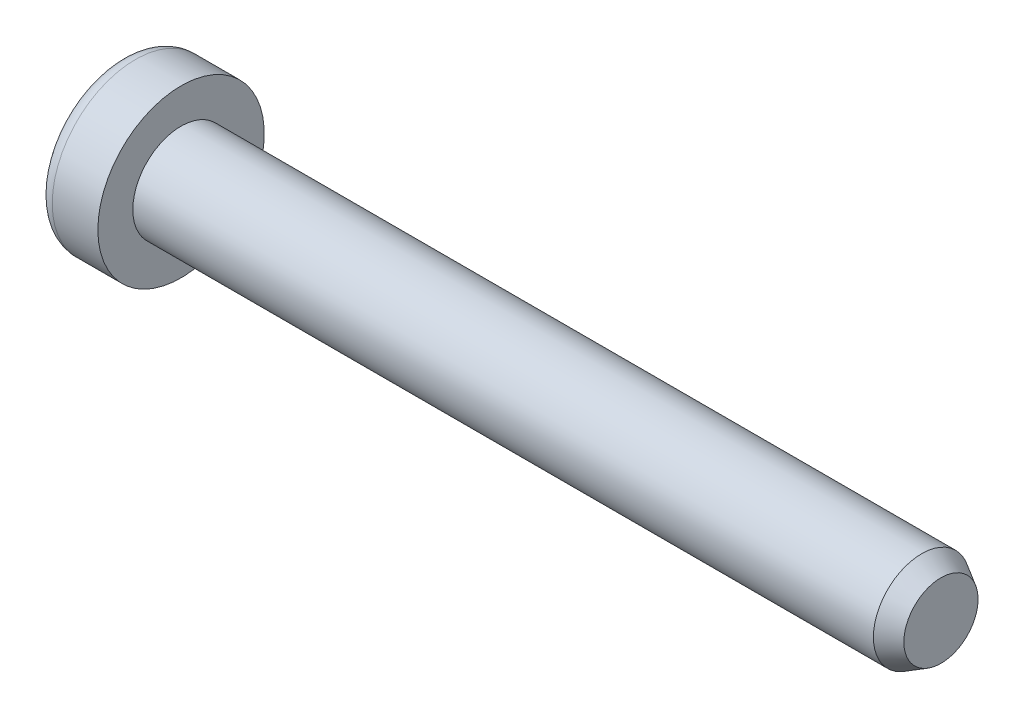
ISO-10303-21;
HEADER;
FILE_DESCRIPTION(('STEP AP214'),'2;1');
FILE_NAME('part.step','',(''),(''),'','','');
FILE_SCHEMA(('AUTOMOTIVE_DESIGN { 1 0 10303 214 1 1 1 1 }'));
ENDSEC;
DATA;
#1=APPLICATION_CONTEXT('core data for automotive mechanical design processes');
#2=APPLICATION_PROTOCOL_DEFINITION('international standard','automotive_design',2000,#1);
#3=PRODUCT_CONTEXT('',#1,'mechanical');
#4=PRODUCT('Part','Part','',(#3));
#5=PRODUCT_RELATED_PRODUCT_CATEGORY('part','',(#4));
#6=PRODUCT_DEFINITION_FORMATION('','',#4);
#7=PRODUCT_DEFINITION_CONTEXT('part definition',#1,'design');
#8=PRODUCT_DEFINITION('design','',#6,#7);
#9=PRODUCT_DEFINITION_SHAPE('','',#8);
#10=(LENGTH_UNIT() NAMED_UNIT(*) SI_UNIT(.MILLI.,.METRE.));
#11=(NAMED_UNIT(*) PLANE_ANGLE_UNIT() SI_UNIT($,.RADIAN.));
#12=(NAMED_UNIT(*) SI_UNIT($,.STERADIAN.) SOLID_ANGLE_UNIT());
#13=UNCERTAINTY_MEASURE_WITH_UNIT(LENGTH_MEASURE(1.E-05),#10,'distance_accuracy_value','');
#14=(GEOMETRIC_REPRESENTATION_CONTEXT(3) GLOBAL_UNCERTAINTY_ASSIGNED_CONTEXT((#13)) GLOBAL_UNIT_ASSIGNED_CONTEXT((#10,
#11,#12)) REPRESENTATION_CONTEXT('',''));
#15=CARTESIAN_POINT('',(0.,0.,0.));
#16=DIRECTION('',(0.,0.,1.));
#17=DIRECTION('',(1.,0.,0.));
#18=AXIS2_PLACEMENT_3D('',#15,#16,#17);
#19=CARTESIAN_POINT('',(-0.2794,0.2413,0.2413));
#20=DIRECTION('',(0.,0.,1.));
#21=DIRECTION('',(1.,0.,0.));
#22=AXIS2_PLACEMENT_3D('',#19,#20,#21);
#23=PLANE('',#22);
#24=DIRECTION('',(1.,0.,0.));
#25=VECTOR('',#24,1.);
#26=CARTESIAN_POINT('',(-0.2794,1.4732,0.2413));
#27=LINE('',#26,#25);
#28=CARTESIAN_POINT('',(-2.03199999873,1.4732,0.2413));
#29=VERTEX_POINT('',#28);
#30=CARTESIAN_POINT('',(-0.2794,1.4732,0.2413));
#31=VERTEX_POINT('',#30);
#32=EDGE_CURVE('E123',#29,#31,#27,.T.);
#33=ORIENTED_EDGE('',*,*,#32,.T.);
#34=DIRECTION('',(0.,1.,0.));
#35=VECTOR('',#34,1.);
#36=CARTESIAN_POINT('',(-0.2794,0.2413,0.2413));
#37=LINE('',#36,#35);
#38=CARTESIAN_POINT('',(-0.2794,0.2413,0.2413));
#39=VERTEX_POINT('',#38);
#40=EDGE_CURVE('E113',#39,#31,#37,.T.);
#41=ORIENTED_EDGE('',*,*,#40,.F.);
#42=DIRECTION('',(1.,0.,0.));
#43=VECTOR('',#42,1.);
#44=CARTESIAN_POINT('',(-0.279400000000001,0.2413,0.2413));
#45=LINE('',#44,#43);
#46=CARTESIAN_POINT('',(-2.03199999873,0.2413,0.2413));
#47=VERTEX_POINT('',#46);
#48=EDGE_CURVE('E377',#39,#47,#45,.F.);
#49=ORIENTED_EDGE('',*,*,#48,.T.);
#50=DIRECTION('',(0.,1.,0.));
#51=VECTOR('',#50,1.);
#52=CARTESIAN_POINT('',(-2.03199999873,0.2413,0.2413));
#53=LINE('',#52,#51);
#54=EDGE_CURVE('E108',#29,#47,#53,.F.);
#55=ORIENTED_EDGE('',*,*,#54,.F.);
#56=EDGE_LOOP('',(#33,#41,#49,#55));
#57=FACE_BOUND('',#56,.T.);
#58=ADVANCED_FACE('F17',(#57),#23,.F.);
#59=CARTESIAN_POINT('',(-0.2794,1.4732,0.2413));
#60=DIRECTION('',(0.,1.,0.));
#61=DIRECTION('',(0.,0.,1.));
#62=AXIS2_PLACEMENT_3D('',#59,#60,#61);
#63=PLANE('',#62);
#64=DIRECTION('',(-1.,0.,0.));
#65=VECTOR('',#64,1.);
#66=CARTESIAN_POINT('',(-0.2794,1.4732,-0.2413));
#67=LINE('',#66,#65);
#68=CARTESIAN_POINT('',(-2.03199999873,1.4732,-0.2413));
#69=VERTEX_POINT('',#68);
#70=CARTESIAN_POINT('',(-0.2794,1.4732,-0.2413));
#71=VERTEX_POINT('',#70);
#72=EDGE_CURVE('E128',#69,#71,#67,.F.);
#73=ORIENTED_EDGE('',*,*,#72,.T.);
#74=DIRECTION('',(0.,0.,1.));
#75=VECTOR('',#74,1.);
#76=CARTESIAN_POINT('',(-0.2794,1.4732,0.2413));
#77=LINE('',#76,#75);
#78=EDGE_CURVE('E116',#31,#71,#77,.F.);
#79=ORIENTED_EDGE('',*,*,#78,.F.);
#80=ORIENTED_EDGE('',*,*,#32,.F.);
#81=DIRECTION('',(0.,0.,1.));
#82=VECTOR('',#81,1.);
#83=CARTESIAN_POINT('',(-2.03199999873,1.4732,0.2413));
#84=LINE('',#83,#82);
#85=EDGE_CURVE('E130',#69,#29,#84,.T.);
#86=ORIENTED_EDGE('',*,*,#85,.F.);
#87=EDGE_LOOP('',(#73,#79,#80,#86));
#88=FACE_BOUND('',#87,.T.);
#89=ADVANCED_FACE('F126',(#88),#63,.F.);
#90=CARTESIAN_POINT('',(-0.279400000000001,0.2413,1.4732));
#91=DIRECTION('',(0.,1.,0.));
#92=DIRECTION('',(0.,0.,1.));
#93=AXIS2_PLACEMENT_3D('',#90,#91,#92);
#94=PLANE('',#93);
#95=ORIENTED_EDGE('',*,*,#48,.F.);
#96=DIRECTION('',(0.,0.,1.));
#97=VECTOR('',#96,1.);
#98=CARTESIAN_POINT('',(-0.279400000000001,0.2413,1.4732));
#99=LINE('',#98,#97);
#100=CARTESIAN_POINT('',(-0.279400000000001,0.2413,1.4732));
#101=VERTEX_POINT('',#100);
#102=EDGE_CURVE('E119',#101,#39,#99,.F.);
#103=ORIENTED_EDGE('',*,*,#102,.F.);
#104=DIRECTION('',(1.,0.,0.));
#105=VECTOR('',#104,1.);
#106=CARTESIAN_POINT('',(-0.279400000000001,0.2413,1.4732));
#107=LINE('',#106,#105);
#108=CARTESIAN_POINT('',(-2.03199999873,0.2413,1.4732));
#109=VERTEX_POINT('',#108);
#110=EDGE_CURVE('E392',#101,#109,#107,.F.);
#111=ORIENTED_EDGE('',*,*,#110,.T.);
#112=DIRECTION('',(0.,0.,1.));
#113=VECTOR('',#112,1.);
#114=CARTESIAN_POINT('',(-2.03199999873,0.2413,1.4732));
#115=LINE('',#114,#113);
#116=EDGE_CURVE('E380',#47,#109,#115,.T.);
#117=ORIENTED_EDGE('',*,*,#116,.F.);
#118=EDGE_LOOP('',(#95,#103,#111,#117));
#119=FACE_BOUND('',#118,.T.);
#120=ADVANCED_FACE('F208',(#119),#94,.F.);
#121=CARTESIAN_POINT('',(-0.2794,1.4732,-0.2413));
#122=DIRECTION('',(0.,0.,-1.));
#123=DIRECTION('',(-1.,0.,0.));
#124=AXIS2_PLACEMENT_3D('',#121,#122,#123);
#125=PLANE('',#124);
#126=DIRECTION('',(1.,0.,0.));
#127=VECTOR('',#126,1.);
#128=CARTESIAN_POINT('',(-0.2794,0.2413,-0.2413));
#129=LINE('',#128,#127);
#130=CARTESIAN_POINT('',(-2.03199999873,0.2413,-0.2413));
#131=VERTEX_POINT('',#130);
#132=CARTESIAN_POINT('',(-0.2794,0.2413,-0.2413));
#133=VERTEX_POINT('',#132);
#134=EDGE_CURVE('E396',#131,#133,#129,.T.);
#135=ORIENTED_EDGE('',*,*,#134,.T.);
#136=DIRECTION('',(0.,1.,0.));
#137=VECTOR('',#136,1.);
#138=CARTESIAN_POINT('',(-0.2794,1.4732,-0.2413));
#139=LINE('',#138,#137);
#140=EDGE_CURVE('E385',#71,#133,#139,.F.);
#141=ORIENTED_EDGE('',*,*,#140,.F.);
#142=ORIENTED_EDGE('',*,*,#72,.F.);
#143=DIRECTION('',(0.,1.,0.));
#144=VECTOR('',#143,1.);
#145=CARTESIAN_POINT('',(-2.03199999873,1.4732,-0.2413));
#146=LINE('',#145,#144);
#147=EDGE_CURVE('E387',#131,#69,#146,.T.);
#148=ORIENTED_EDGE('',*,*,#147,.F.);
#149=EDGE_LOOP('',(#135,#141,#142,#148));
#150=FACE_BOUND('',#149,.T.);
#151=ADVANCED_FACE('F204',(#150),#125,.F.);
#152=CARTESIAN_POINT('',(-0.279400000000001,-0.2413,1.4732));
#153=DIRECTION('',(0.,0.,1.));
#154=DIRECTION('',(1.,0.,0.));
#155=AXIS2_PLACEMENT_3D('',#152,#153,#154);
#156=PLANE('',#155);
#157=ORIENTED_EDGE('',*,*,#110,.F.);
#158=DIRECTION('',(0.,1.,0.));
#159=VECTOR('',#158,1.);
#160=CARTESIAN_POINT('',(-0.279400000000001,-0.2413,1.4732));
#161=LINE('',#160,#159);
#162=CARTESIAN_POINT('',(-0.279400000000001,-0.2413,1.4732));
#163=VERTEX_POINT('',#162);
#164=EDGE_CURVE('E390',#163,#101,#161,.T.);
#165=ORIENTED_EDGE('',*,*,#164,.F.);
#166=DIRECTION('',(1.,0.,0.));
#167=VECTOR('',#166,1.);
#168=CARTESIAN_POINT('',(-0.2794,-0.2413,1.4732));
#169=LINE('',#168,#167);
#170=CARTESIAN_POINT('',(-2.03199999873,-0.2413,1.4732));
#171=VERTEX_POINT('',#170);
#172=EDGE_CURVE('E406',#163,#171,#169,.F.);
#173=ORIENTED_EDGE('',*,*,#172,.T.);
#174=DIRECTION('',(0.,1.,0.));
#175=VECTOR('',#174,1.);
#176=CARTESIAN_POINT('',(-2.03199999873,-0.2413,1.4732));
#177=LINE('',#176,#175);
#178=EDGE_CURVE('E394',#109,#171,#177,.F.);
#179=ORIENTED_EDGE('',*,*,#178,.F.);
#180=EDGE_LOOP('',(#157,#165,#173,#179));
#181=FACE_BOUND('',#180,.T.);
#182=ADVANCED_FACE('F200',(#181),#156,.F.);
#183=CARTESIAN_POINT('',(-0.2794,0.2413,-0.2413));
#184=DIRECTION('',(0.,1.,0.));
#185=DIRECTION('',(0.,0.,1.));
#186=AXIS2_PLACEMENT_3D('',#183,#184,#185);
#187=PLANE('',#186);
#188=DIRECTION('',(-1.,0.,0.));
#189=VECTOR('',#188,1.);
#190=CARTESIAN_POINT('',(-0.2794,0.2413,-1.4732));
#191=LINE('',#190,#189);
#192=CARTESIAN_POINT('',(-2.03199999873,0.2413,-1.4732));
#193=VERTEX_POINT('',#192);
#194=CARTESIAN_POINT('',(-0.2794,0.2413,-1.4732));
#195=VERTEX_POINT('',#194);
#196=EDGE_CURVE('E411',#193,#195,#191,.F.);
#197=ORIENTED_EDGE('',*,*,#196,.T.);
#198=DIRECTION('',(0.,0.,1.));
#199=VECTOR('',#198,1.);
#200=CARTESIAN_POINT('',(-0.2794,0.2413,-0.2413));
#201=LINE('',#200,#199);
#202=EDGE_CURVE('E399',#133,#195,#201,.F.);
#203=ORIENTED_EDGE('',*,*,#202,.F.);
#204=ORIENTED_EDGE('',*,*,#134,.F.);
#205=DIRECTION('',(0.,0.,1.));
#206=VECTOR('',#205,1.);
#207=CARTESIAN_POINT('',(-2.03199999873,0.2413,-0.2413));
#208=LINE('',#207,#206);
#209=EDGE_CURVE('E401',#193,#131,#208,.T.);
#210=ORIENTED_EDGE('',*,*,#209,.F.);
#211=EDGE_LOOP('',(#197,#203,#204,#210));
#212=FACE_BOUND('',#211,.T.);
#213=ADVANCED_FACE('F196',(#212),#187,.F.);
#214=CARTESIAN_POINT('',(-0.2794,-0.2413,0.2413));
#215=DIRECTION('',(0.,-1.,0.));
#216=DIRECTION('',(0.,0.,-1.));
#217=AXIS2_PLACEMENT_3D('',#214,#215,#216);
#218=PLANE('',#217);
#219=ORIENTED_EDGE('',*,*,#172,.F.);
#220=DIRECTION('',(0.,0.,-1.));
#221=VECTOR('',#220,1.);
#222=CARTESIAN_POINT('',(-0.2794,-0.2413,0.2413));
#223=LINE('',#222,#221);
#224=CARTESIAN_POINT('',(-0.2794,-0.2413,0.2413));
#225=VERTEX_POINT('',#224);
#226=EDGE_CURVE('E404',#225,#163,#223,.F.);
#227=ORIENTED_EDGE('',*,*,#226,.F.);
#228=DIRECTION('',(1.,0.,0.));
#229=VECTOR('',#228,1.);
#230=CARTESIAN_POINT('',(-0.2794,-0.2413,0.2413));
#231=LINE('',#230,#229);
#232=CARTESIAN_POINT('',(-2.03199999873,-0.2413,0.2413));
#233=VERTEX_POINT('',#232);
#234=EDGE_CURVE('E419',#225,#233,#231,.F.);
#235=ORIENTED_EDGE('',*,*,#234,.T.);
#236=DIRECTION('',(0.,0.,-1.));
#237=VECTOR('',#236,1.);
#238=CARTESIAN_POINT('',(-2.03199999873,-0.2413,0.2413));
#239=LINE('',#238,#237);
#240=EDGE_CURVE('E409',#171,#233,#239,.T.);
#241=ORIENTED_EDGE('',*,*,#240,.F.);
#242=EDGE_LOOP('',(#219,#227,#235,#241));
#243=FACE_BOUND('',#242,.T.);
#244=ADVANCED_FACE('F192',(#243),#218,.F.);
#245=CARTESIAN_POINT('',(-0.2794,0.2413,-1.4732));
#246=DIRECTION('',(0.,0.,-1.));
#247=DIRECTION('',(-1.,0.,0.));
#248=AXIS2_PLACEMENT_3D('',#245,#246,#247);
#249=PLANE('',#248);
#250=DIRECTION('',(1.,0.,0.));
#251=VECTOR('',#250,1.);
#252=CARTESIAN_POINT('',(-0.2794,-0.2413,-1.4732));
#253=LINE('',#252,#251);
#254=CARTESIAN_POINT('',(-2.03199999873,-0.2413,-1.4732));
#255=VERTEX_POINT('',#254);
#256=CARTESIAN_POINT('',(-0.2794,-0.2413,-1.4732));
#257=VERTEX_POINT('',#256);
#258=EDGE_CURVE('E424',#255,#257,#253,.T.);
#259=ORIENTED_EDGE('',*,*,#258,.T.);
#260=DIRECTION('',(0.,1.,0.));
#261=VECTOR('',#260,1.);
#262=CARTESIAN_POINT('',(-0.2794,0.2413,-1.4732));
#263=LINE('',#262,#261);
#264=EDGE_CURVE('E414',#195,#257,#263,.F.);
#265=ORIENTED_EDGE('',*,*,#264,.F.);
#266=ORIENTED_EDGE('',*,*,#196,.F.);
#267=DIRECTION('',(0.,1.,0.));
#268=VECTOR('',#267,1.);
#269=CARTESIAN_POINT('',(-2.03199999873,0.2413,-1.4732));
#270=LINE('',#269,#268);
#271=EDGE_CURVE('E416',#255,#193,#270,.T.);
#272=ORIENTED_EDGE('',*,*,#271,.F.);
#273=EDGE_LOOP('',(#259,#265,#266,#272));
#274=FACE_BOUND('',#273,.T.);
#275=ADVANCED_FACE('F188',(#274),#249,.F.);
#276=CARTESIAN_POINT('',(-0.2794,-1.4732,0.2413));
#277=DIRECTION('',(0.,0.,1.));
#278=DIRECTION('',(1.,0.,0.));
#279=AXIS2_PLACEMENT_3D('',#276,#277,#278);
#280=PLANE('',#279);
#281=ORIENTED_EDGE('',*,*,#234,.F.);
#282=DIRECTION('',(0.,1.,0.));
#283=VECTOR('',#282,1.);
#284=CARTESIAN_POINT('',(-0.2794,-0.2413,0.2413));
#285=LINE('',#284,#283);
#286=CARTESIAN_POINT('',(-0.2794,-1.4732,0.2413));
#287=VERTEX_POINT('',#286);
#288=EDGE_CURVE('E430',#225,#287,#285,.F.);
#289=ORIENTED_EDGE('',*,*,#288,.T.);
#290=DIRECTION('',(1.,0.,0.));
#291=VECTOR('',#290,1.);
#292=CARTESIAN_POINT('',(-0.2794,-1.4732,0.2413));
#293=LINE('',#292,#291);
#294=CARTESIAN_POINT('',(-2.03199999873,-1.4732,0.2413));
#295=VERTEX_POINT('',#294);
#296=EDGE_CURVE('E438',#287,#295,#293,.F.);
#297=ORIENTED_EDGE('',*,*,#296,.T.);
#298=DIRECTION('',(0.,1.,0.));
#299=VECTOR('',#298,1.);
#300=CARTESIAN_POINT('',(-2.03199999873,-1.4732,0.2413));
#301=LINE('',#300,#299);
#302=EDGE_CURVE('E422',#233,#295,#301,.F.);
#303=ORIENTED_EDGE('',*,*,#302,.F.);
#304=EDGE_LOOP('',(#281,#289,#297,#303));
#305=FACE_BOUND('',#304,.T.);
#306=ADVANCED_FACE('F184',(#305),#280,.F.);
#307=CARTESIAN_POINT('',(-0.2794,-0.2413,-1.4732));
#308=DIRECTION('',(0.,-1.,0.));
#309=DIRECTION('',(0.,0.,-1.));
#310=AXIS2_PLACEMENT_3D('',#307,#308,#309);
#311=PLANE('',#310);
#312=DIRECTION('',(-1.,0.,0.));
#313=VECTOR('',#312,1.);
#314=CARTESIAN_POINT('',(-0.2794,-0.2413,-0.2413));
#315=LINE('',#314,#313);
#316=CARTESIAN_POINT('',(-2.03199999873,-0.2413,-0.2413));
#317=VERTEX_POINT('',#316);
#318=CARTESIAN_POINT('',(-0.2794,-0.2413,-0.2413));
#319=VERTEX_POINT('',#318);
#320=EDGE_CURVE('E444',#317,#319,#315,.F.);
#321=ORIENTED_EDGE('',*,*,#320,.T.);
#322=DIRECTION('',(0.,0.,-1.));
#323=VECTOR('',#322,1.);
#324=CARTESIAN_POINT('',(-0.2794,-0.2413,-0.2413));
#325=LINE('',#324,#323);
#326=EDGE_CURVE('E432',#319,#257,#325,.T.);
#327=ORIENTED_EDGE('',*,*,#326,.T.);
#328=ORIENTED_EDGE('',*,*,#258,.F.);
#329=DIRECTION('',(0.,0.,-1.));
#330=VECTOR('',#329,1.);
#331=CARTESIAN_POINT('',(-2.03199999873,-0.2413,-1.4732));
#332=LINE('',#331,#330);
#333=EDGE_CURVE('E427',#317,#255,#332,.T.);
#334=ORIENTED_EDGE('',*,*,#333,.F.);
#335=EDGE_LOOP('',(#321,#327,#328,#334));
#336=FACE_BOUND('',#335,.T.);
#337=ADVANCED_FACE('F181',(#336),#311,.F.);
#338=CARTESIAN_POINT('',(-0.2794,-0.2413,-0.2413));
#339=DIRECTION('',(1.,0.,0.));
#340=DIRECTION('',(0.,0.,-1.));
#341=AXIS2_PLACEMENT_3D('',#338,#339,#340);
#342=PLANE('',#341);
#343=DIRECTION('',(0.,1.,0.));
#344=VECTOR('',#343,1.);
#345=CARTESIAN_POINT('',(-0.2794,-0.2413,-0.2413));
#346=LINE('',#345,#344);
#347=CARTESIAN_POINT('',(-0.2794,-1.4732,-0.2413));
#348=VERTEX_POINT('',#347);
#349=EDGE_CURVE('E446',#319,#348,#346,.F.);
#350=ORIENTED_EDGE('',*,*,#349,.T.);
#351=DIRECTION('',(0.,0.,-1.));
#352=VECTOR('',#351,1.);
#353=CARTESIAN_POINT('',(-0.2794,-1.4732,-0.2413));
#354=LINE('',#353,#352);
#355=EDGE_CURVE('E435',#348,#287,#354,.F.);
#356=ORIENTED_EDGE('',*,*,#355,.T.);
#357=ORIENTED_EDGE('',*,*,#288,.F.);
#358=ORIENTED_EDGE('',*,*,#226,.T.);
#359=ORIENTED_EDGE('',*,*,#164,.T.);
#360=ORIENTED_EDGE('',*,*,#102,.T.);
#361=ORIENTED_EDGE('',*,*,#40,.T.);
#362=ORIENTED_EDGE('',*,*,#78,.T.);
#363=ORIENTED_EDGE('',*,*,#140,.T.);
#364=ORIENTED_EDGE('',*,*,#202,.T.);
#365=ORIENTED_EDGE('',*,*,#264,.T.);
#366=ORIENTED_EDGE('',*,*,#326,.F.);
#367=EDGE_LOOP('',(#350,#356,#357,#358,#359,#360,#361,#362,#363,#364,#365,#366));
#368=FACE_BOUND('',#367,.T.);
#369=ADVANCED_FACE('F114',(#368),#342,.F.);
#370=CARTESIAN_POINT('',(-0.2794,-1.4732,-0.2413));
#371=DIRECTION('',(0.,-1.,0.));
#372=DIRECTION('',(0.,0.,-1.));
#373=AXIS2_PLACEMENT_3D('',#370,#371,#372);
#374=PLANE('',#373);
#375=ORIENTED_EDGE('',*,*,#296,.F.);
#376=ORIENTED_EDGE('',*,*,#355,.F.);
#377=DIRECTION('',(-1.,0.,0.));
#378=VECTOR('',#377,1.);
#379=CARTESIAN_POINT('',(-0.2794,-1.4732,-0.2413));
#380=LINE('',#379,#378);
#381=CARTESIAN_POINT('',(-2.03199999873,-1.4732,-0.2413));
#382=VERTEX_POINT('',#381);
#383=EDGE_CURVE('E448',#348,#382,#380,.T.);
#384=ORIENTED_EDGE('',*,*,#383,.T.);
#385=DIRECTION('',(0.,0.,-1.));
#386=VECTOR('',#385,1.);
#387=CARTESIAN_POINT('',(-2.03199999873,-1.4732,-0.2413));
#388=LINE('',#387,#386);
#389=EDGE_CURVE('E441',#295,#382,#388,.T.);
#390=ORIENTED_EDGE('',*,*,#389,.F.);
#391=EDGE_LOOP('',(#375,#376,#384,#390));
#392=FACE_BOUND('',#391,.T.);
#393=ADVANCED_FACE('F174',(#392),#374,.F.);
#394=CARTESIAN_POINT('',(-0.2794,-0.2413,-0.2413));
#395=DIRECTION('',(0.,0.,-1.));
#396=DIRECTION('',(-1.,0.,0.));
#397=AXIS2_PLACEMENT_3D('',#394,#395,#396);
#398=PLANE('',#397);
#399=ORIENTED_EDGE('',*,*,#383,.F.);
#400=ORIENTED_EDGE('',*,*,#349,.F.);
#401=ORIENTED_EDGE('',*,*,#320,.F.);
#402=DIRECTION('',(0.,1.,0.));
#403=VECTOR('',#402,1.);
#404=CARTESIAN_POINT('',(-2.03199999873,0.,-0.2413));
#405=LINE('',#404,#403);
#406=EDGE_CURVE('E147',#317,#382,#405,.F.);
#407=ORIENTED_EDGE('',*,*,#406,.T.);
#408=EDGE_LOOP('',(#399,#400,#401,#407));
#409=FACE_BOUND('',#408,.T.);
#410=ADVANCED_FACE('F166',(#409),#398,.F.);
#411=CARTESIAN_POINT('',(-2.03199999873,0.,0.));
#412=DIRECTION('',(1.,0.,0.));
#413=DIRECTION('',(0.,0.,-1.));
#414=AXIS2_PLACEMENT_3D('',#411,#412,#413);
#415=PLANE('',#414);
#416=ORIENTED_EDGE('',*,*,#333,.T.);
#417=ORIENTED_EDGE('',*,*,#271,.T.);
#418=ORIENTED_EDGE('',*,*,#209,.T.);
#419=ORIENTED_EDGE('',*,*,#147,.T.);
#420=ORIENTED_EDGE('',*,*,#85,.T.);
#421=ORIENTED_EDGE('',*,*,#54,.T.);
#422=ORIENTED_EDGE('',*,*,#116,.T.);
#423=ORIENTED_EDGE('',*,*,#178,.T.);
#424=ORIENTED_EDGE('',*,*,#240,.T.);
#425=ORIENTED_EDGE('',*,*,#302,.T.);
#426=ORIENTED_EDGE('',*,*,#389,.T.);
#427=ORIENTED_EDGE('',*,*,#406,.F.);
#428=EDGE_LOOP('',(#416,#417,#418,#419,#420,#421,#422,#423,#424,#425,#426,#427));
#429=FACE_BOUND('',#428,.T.);
#430=CARTESIAN_POINT('',(-2.03199999873,0.,0.));
#431=DIRECTION('',(1.,0.,0.));
#432=DIRECTION('',(0.,0.,-1.));
#433=AXIS2_PLACEMENT_3D('',#430,#431,#432);
#434=CIRCLE('',#433,2.2733);
#435=CARTESIAN_POINT('',(-2.03199999873,0.,-2.2733));
#436=VERTEX_POINT('',#435);
#437=CARTESIAN_POINT('',(-2.03199999873,0.,2.2733));
#438=VERTEX_POINT('',#437);
#439=EDGE_CURVE('E36',#436,#438,#434,.T.);
#440=ORIENTED_EDGE('',*,*,#439,.F.);
#441=CARTESIAN_POINT('',(-2.03199999873,0.,0.));
#442=DIRECTION('',(1.,0.,0.));
#443=DIRECTION('',(0.,0.,1.));
#444=AXIS2_PLACEMENT_3D('',#441,#442,#443);
#445=CIRCLE('',#444,2.2733);
#446=EDGE_CURVE('E145',#438,#436,#445,.T.);
#447=ORIENTED_EDGE('',*,*,#446,.F.);
#448=EDGE_LOOP('',(#440,#447));
#449=FACE_BOUND('',#448,.T.);
#450=ADVANCED_FACE('F149',(#429,#449),#415,.F.);
#451=CARTESIAN_POINT('',(-1.52399999873,0.,0.));
#452=DIRECTION('',(1.,0.,0.));
#453=DIRECTION('',(0.,0.,-1.));
#454=AXIS2_PLACEMENT_3D('',#451,#452,#453);
#455=TOROIDAL_SURFACE('',#454,2.2733,0.508);
#456=ORIENTED_EDGE('',*,*,#439,.T.);
#457=ORIENTED_EDGE('',*,*,#446,.T.);
#458=EDGE_LOOP('',(#456,#457));
#459=FACE_BOUND('',#458,.T.);
#460=CARTESIAN_POINT('',(-1.52399999873,0.,0.));
#461=DIRECTION('',(-1.,0.,0.));
#462=DIRECTION('',(0.,0.,1.));
#463=AXIS2_PLACEMENT_3D('',#460,#461,#462);
#464=CIRCLE('',#463,2.7813);
#465=CARTESIAN_POINT('',(-1.52399999873,0.,2.7813));
#466=VERTEX_POINT('',#465);
#467=EDGE_CURVE('E141',#466,#466,#464,.F.);
#468=ORIENTED_EDGE('',*,*,#467,.F.);
#469=EDGE_LOOP('',(#468));
#470=FACE_BOUND('',#469,.T.);
#471=ADVANCED_FACE('F143',(#459,#470),#455,.T.);
#472=CARTESIAN_POINT('',(25.4,0.,0.));
#473=DIRECTION('',(1.,0.,0.));
#474=DIRECTION('',(0.,0.,-1.));
#475=AXIS2_PLACEMENT_3D('',#472,#473,#474);
#476=PLANE('',#475);
#477=CARTESIAN_POINT('',(25.3999999999905,0.,0.));
#478=DIRECTION('',(-1.,0.,0.));
#479=DIRECTION('',(0.,0.,1.));
#480=AXIS2_PLACEMENT_3D('',#477,#478,#479);
#481=CIRCLE('',#480,1.24041670041546);
#482=CARTESIAN_POINT('',(25.3999999999905,0.,1.24041670041546));
#483=VERTEX_POINT('',#482);
#484=EDGE_CURVE('E139',#483,#483,#481,.T.);
#485=ORIENTED_EDGE('',*,*,#484,.F.);
#486=EDGE_LOOP('',(#485));
#487=FACE_BOUND('',#486,.T.);
#488=ADVANCED_FACE('F235',(#487),#476,.T.);
#489=CARTESIAN_POINT('',(0.,0.,0.));
#490=DIRECTION('',(-1.,0.,0.));
#491=DIRECTION('',(0.,0.,1.));
#492=AXIS2_PLACEMENT_3D('',#489,#490,#491);
#493=CYLINDRICAL_SURFACE('',#492,2.7813);
#494=CARTESIAN_POINT('',(0.,0.,0.));
#495=DIRECTION('',(-1.,0.,0.));
#496=DIRECTION('',(0.,0.,1.));
#497=AXIS2_PLACEMENT_3D('',#494,#495,#496);
#498=CIRCLE('',#497,2.7813);
#499=CARTESIAN_POINT('',(0.,0.,2.7813));
#500=VERTEX_POINT('',#499);
#501=EDGE_CURVE('E136',#500,#500,#498,.F.);
#502=ORIENTED_EDGE('',*,*,#501,.F.);
#503=EDGE_LOOP('',(#502));
#504=FACE_BOUND('',#503,.T.);
#505=ORIENTED_EDGE('',*,*,#467,.T.);
#506=EDGE_LOOP('',(#505));
#507=FACE_BOUND('',#506,.T.);
#508=ADVANCED_FACE('F232',(#504,#507),#493,.T.);
#509=CARTESIAN_POINT('',(24.7548400002415,0.,0.));
#510=DIRECTION('',(-1.,0.,0.));
#511=DIRECTION('',(0.,0.,1.));
#512=AXIS2_PLACEMENT_3D('',#509,#510,#511);
#513=CONICAL_SURFACE('',#512,1.61289999994097,0.523598775598337);
#514=ORIENTED_EDGE('',*,*,#484,.T.);
#515=EDGE_LOOP('',(#514));
#516=FACE_BOUND('',#515,.T.);
#517=CARTESIAN_POINT('',(24.75484,0.,0.));
#518=DIRECTION('',(-1.,0.,0.));
#519=DIRECTION('',(0.,0.,1.));
#520=AXIS2_PLACEMENT_3D('',#517,#518,#519);
#521=CIRCLE('',#520,1.6129);
#522=CARTESIAN_POINT('',(24.75484,0.,1.61290000000001));
#523=VERTEX_POINT('',#522);
#524=EDGE_CURVE('E28',#523,#523,#521,.T.);
#525=ORIENTED_EDGE('',*,*,#524,.F.);
#526=EDGE_LOOP('',(#525));
#527=FACE_BOUND('',#526,.T.);
#528=ADVANCED_FACE('F225',(#516,#527),#513,.T.);
#529=CARTESIAN_POINT('',(0.,0.,0.));
#530=DIRECTION('',(1.,0.,0.));
#531=DIRECTION('',(0.,0.,-1.));
#532=AXIS2_PLACEMENT_3D('',#529,#530,#531);
#533=PLANE('',#532);
#534=CARTESIAN_POINT('',(0.,0.,0.));
#535=DIRECTION('',(-1.,0.,0.));
#536=DIRECTION('',(0.,0.,1.));
#537=AXIS2_PLACEMENT_3D('',#534,#535,#536);
#538=CIRCLE('',#537,1.6129);
#539=CARTESIAN_POINT('',(0.,0.,1.6129));
#540=VERTEX_POINT('',#539);
#541=EDGE_CURVE('E11',#540,#540,#538,.F.);
#542=ORIENTED_EDGE('',*,*,#541,.F.);
#543=EDGE_LOOP('',(#542));
#544=FACE_BOUND('',#543,.T.);
#545=ORIENTED_EDGE('',*,*,#501,.T.);
#546=EDGE_LOOP('',(#545));
#547=FACE_BOUND('',#546,.T.);
#548=ADVANCED_FACE('F219',(#544,#547),#533,.T.);
#549=CARTESIAN_POINT('',(24.75484,0.,0.));
#550=DIRECTION('',(-1.,0.,0.));
#551=DIRECTION('',(0.,0.,1.));
#552=AXIS2_PLACEMENT_3D('',#549,#550,#551);
#553=CYLINDRICAL_SURFACE('',#552,1.6129);
#554=ORIENTED_EDGE('',*,*,#541,.T.);
#555=EDGE_LOOP('',(#554));
#556=FACE_BOUND('',#555,.T.);
#557=ORIENTED_EDGE('',*,*,#524,.T.);
#558=EDGE_LOOP('',(#557));
#559=FACE_BOUND('',#558,.T.);
#560=ADVANCED_FACE('F217',(#556,#559),#553,.T.);
#561=CLOSED_SHELL('',(#58,#89,#120,#151,#182,#213,#244,#275,#306,#337,#369,#393,#410,#450,#471,
#488,#508,#528,#548,#560));
#562=MANIFOLD_SOLID_BREP('B1',#561);
#563=ADVANCED_BREP_SHAPE_REPRESENTATION('',(#18,#562),#14);
#564=SHAPE_DEFINITION_REPRESENTATION(#9,#563);
ENDSEC;
END-ISO-10303-21;
